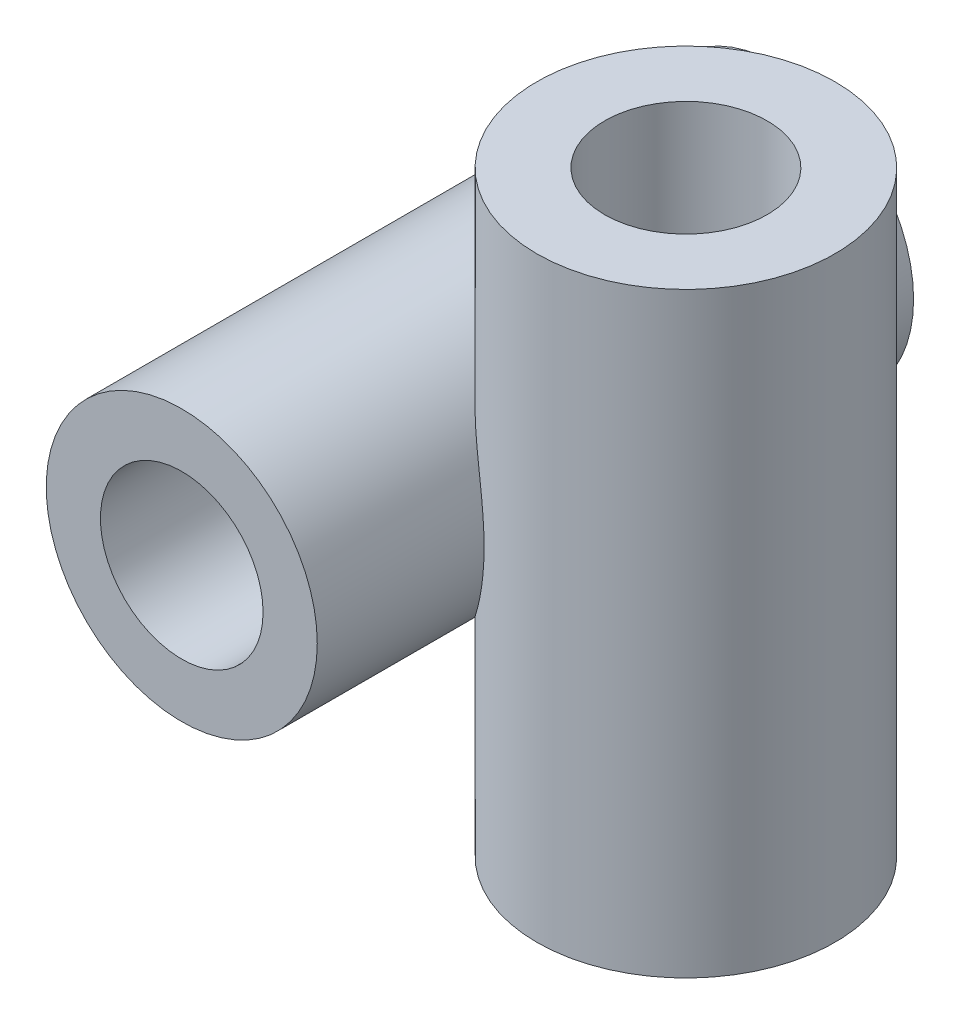
ISO-10303-21;
HEADER;
FILE_DESCRIPTION(('STEP AP214'),'2;1');
FILE_NAME('part.step','',(''),(''),'','','');
FILE_SCHEMA(('AUTOMOTIVE_DESIGN { 1 0 10303 214 1 1 1 1 }'));
ENDSEC;
DATA;
#1=APPLICATION_CONTEXT('core data for automotive mechanical design processes');
#2=APPLICATION_PROTOCOL_DEFINITION('international standard','automotive_design',2000,#1);
#3=PRODUCT_CONTEXT('',#1,'mechanical');
#4=PRODUCT('Part','Part','',(#3));
#5=PRODUCT_RELATED_PRODUCT_CATEGORY('part','',(#4));
#6=PRODUCT_DEFINITION_FORMATION('','',#4);
#7=PRODUCT_DEFINITION_CONTEXT('part definition',#1,'design');
#8=PRODUCT_DEFINITION('design','',#6,#7);
#9=PRODUCT_DEFINITION_SHAPE('','',#8);
#10=(LENGTH_UNIT() NAMED_UNIT(*) SI_UNIT(.MILLI.,.METRE.));
#11=(NAMED_UNIT(*) PLANE_ANGLE_UNIT() SI_UNIT($,.RADIAN.));
#12=(NAMED_UNIT(*) SI_UNIT($,.STERADIAN.) SOLID_ANGLE_UNIT());
#13=UNCERTAINTY_MEASURE_WITH_UNIT(LENGTH_MEASURE(1.E-05),#10,'distance_accuracy_value','');
#14=(GEOMETRIC_REPRESENTATION_CONTEXT(3) GLOBAL_UNCERTAINTY_ASSIGNED_CONTEXT((#13)) GLOBAL_UNIT_ASSIGNED_CONTEXT((#10,
#11,#12)) REPRESENTATION_CONTEXT('',''));
#15=CARTESIAN_POINT('',(0.,0.,0.));
#16=DIRECTION('',(0.,0.,1.));
#17=DIRECTION('',(1.,0.,0.));
#18=AXIS2_PLACEMENT_3D('',#15,#16,#17);
#19=CARTESIAN_POINT('',(0.,0.,110.));
#20=DIRECTION('',(0.,0.,-1.));
#21=DIRECTION('',(-1.,0.,0.));
#22=AXIS2_PLACEMENT_3D('',#19,#20,#21);
#23=CYLINDRICAL_SURFACE('',#22,25.);
#24=CARTESIAN_POINT('',(0.,0.,110.));
#25=DIRECTION('',(0.,0.,1.));
#26=DIRECTION('',(1.,0.,0.));
#27=AXIS2_PLACEMENT_3D('',#24,#25,#26);
#28=CIRCLE('',#27,25.);
#29=CARTESIAN_POINT('',(25.,0.,110.));
#30=VERTEX_POINT('',#29);
#31=EDGE_CURVE('E42',#30,#30,#28,.T.);
#32=ORIENTED_EDGE('',*,*,#31,.F.);
#33=EDGE_LOOP('',(#32));
#34=FACE_BOUND('',#33,.T.);
#35=CARTESIAN_POINT('',(0.,0.,0.));
#36=DIRECTION('',(0.,0.,1.));
#37=DIRECTION('',(1.,0.,0.));
#38=AXIS2_PLACEMENT_3D('',#35,#36,#37);
#39=CIRCLE('',#38,25.);
#40=CARTESIAN_POINT('',(25.,0.,0.));
#41=VERTEX_POINT('',#40);
#42=EDGE_CURVE('E46',#41,#41,#39,.T.);
#43=ORIENTED_EDGE('',*,*,#42,.T.);
#44=EDGE_LOOP('',(#43));
#45=FACE_BOUND('',#44,.T.);
#46=CARTESIAN_POINT('',(25.,0.,79.2332416321053));
#47=CARTESIAN_POINT('',(25.0000007825985,-0.600816842864654,79.2332410858516));
#48=CARTESIAN_POINT('',(24.9783217710084,-1.20162132374293,79.2216494263002));
#49=CARTESIAN_POINT('',(24.8918506726252,-2.39919808909054,79.1749631811382));
#50=CARTESIAN_POINT('',(24.8270596735405,-2.99597047490526,79.1398691884874));
#51=CARTESIAN_POINT('',(24.655121507116,-4.18133721090223,79.0452455780874));
#52=CARTESIAN_POINT('',(24.5479808379827,-4.76993280140982,78.9857197091536));
#53=CARTESIAN_POINT('',(24.2926399312228,-5.93491483313067,78.8407177475658));
#54=CARTESIAN_POINT('',(24.1444395414395,-6.51130122909126,78.7552415587465));
#55=CARTESIAN_POINT('',(23.8085180063826,-7.64899058259393,78.5561039071485));
#56=CARTESIAN_POINT('',(23.6207047510391,-8.21025488587826,78.4423766418513));
#57=CARTESIAN_POINT('',(23.2084644972328,-9.31198548220995,78.1844679143403));
#58=CARTESIAN_POINT('',(22.9840375126994,-9.85245178316974,78.0402864637128));
#59=CARTESIAN_POINT('',(22.5022339022703,-10.9080663425764,77.7190007674117));
#60=CARTESIAN_POINT('',(22.2448713606717,-11.4232252936945,77.5419105800159));
#61=CARTESIAN_POINT('',(21.7016362124861,-12.4243001990804,77.1523130211464));
#62=CARTESIAN_POINT('',(21.4157649861155,-12.9102175672225,76.9398073639395));
#63=CARTESIAN_POINT('',(20.8316029091069,-13.8322635144308,76.4855310011844));
#64=CARTESIAN_POINT('',(20.534117728904,-14.2695493114449,76.2450731185213));
#65=CARTESIAN_POINT('',(19.9234479220036,-15.1104673939661,75.7279582301033));
#66=CARTESIAN_POINT('',(19.6102637492925,-15.5141006517458,75.4513022707589));
#67=CARTESIAN_POINT('',(18.9746159658947,-16.2853813779598,74.8613356253751));
#68=CARTESIAN_POINT('',(18.6521555838678,-16.6530411757564,74.548037579252));
#69=CARTESIAN_POINT('',(18.0044968462312,-17.3512208021058,73.8850341435191));
#70=CARTESIAN_POINT('',(17.6792985669926,-17.6817416629488,73.5353297663573));
#71=CARTESIAN_POINT('',(17.0498353446205,-18.2889103322939,72.8200862352658));
#72=CARTESIAN_POINT('',(16.7453694646409,-18.5674779820506,72.4563491668873));
#73=CARTESIAN_POINT('',(16.1453294165259,-19.0915438736716,71.6990041039122));
#74=CARTESIAN_POINT('',(15.8497549014439,-19.3370434071776,71.3053972769689));
#75=CARTESIAN_POINT('',(15.2723284606574,-19.7962662822146,70.4903980152244));
#76=CARTESIAN_POINT('',(14.9904802784984,-20.009980987435,70.0689980734397));
#77=CARTESIAN_POINT('',(14.4448971265196,-20.4073241806219,69.2010535594379));
#78=CARTESIAN_POINT('',(14.1811630217334,-20.5909512323394,68.7545077882384));
#79=CARTESIAN_POINT('',(13.6634972035866,-20.9382566772376,67.8173544378414));
#80=CARTESIAN_POINT('',(13.4106211621533,-21.1005785575662,67.3256616859445));
#81=CARTESIAN_POINT('',(12.9322018126191,-21.3971352366966,66.3210034042578));
#82=CARTESIAN_POINT('',(12.7066591188469,-21.5313694042643,65.8080373966902));
#83=CARTESIAN_POINT('',(12.2855450455021,-21.7744007774588,64.7639037862788));
#84=CARTESIAN_POINT('',(12.0899840669711,-21.8831891624662,64.2327299447441));
#85=CARTESIAN_POINT('',(11.7310063704868,-22.0777072635418,63.1555120906414));
#86=CARTESIAN_POINT('',(11.5675914440205,-22.1634356945856,62.6094672512481));
#87=CARTESIAN_POINT('',(11.2572811501676,-22.3228047180398,61.4408101254849));
#88=CARTESIAN_POINT('',(11.1145708227286,-22.3938485359219,60.816728560687));
#89=CARTESIAN_POINT('',(10.8727820315224,-22.5122347319977,59.5579496667388));
#90=CARTESIAN_POINT('',(10.7737065258495,-22.5595755033428,58.9232516209021));
#91=CARTESIAN_POINT('',(10.6201389463878,-22.6322752656993,57.6469757557982));
#92=CARTESIAN_POINT('',(10.5656652193296,-22.6576252111434,57.0053952152748));
#93=CARTESIAN_POINT('',(10.501877108889,-22.6872605010107,55.7195073776746));
#94=CARTESIAN_POINT('',(10.4925640351782,-22.691545234537,55.0752000020612));
#95=CARTESIAN_POINT('',(10.5202246376709,-22.6787393960102,53.7377571324116));
#96=CARTESIAN_POINT('',(10.5608434526991,-22.6599655887649,53.0447094477329));
#97=CARTESIAN_POINT('',(10.6942009788091,-22.5973331177627,51.6647480651617));
#98=CARTESIAN_POINT('',(10.7869428438268,-22.5534729360408,50.9778347410113));
#99=CARTESIAN_POINT('',(11.0235422305059,-22.4387790727709,49.6149089037364));
#100=CARTESIAN_POINT('',(11.1674152919376,-22.3679371904867,48.9388997699756));
#101=CARTESIAN_POINT('',(11.5045112775514,-22.1964403506841,47.6031440629806));
#102=CARTESIAN_POINT('',(11.6977329280414,-22.0957861626136,46.9433970705007));
#103=CARTESIAN_POINT('',(12.129984291568,-21.8614645865276,45.6481877789849));
#104=CARTESIAN_POINT('',(12.3688209888673,-21.7279356401813,45.0126362258468));
#105=CARTESIAN_POINT('',(12.8891109356744,-21.4233896570758,43.7684446823527));
#106=CARTESIAN_POINT('',(13.170564816798,-21.2523720646925,43.1598050910231));
#107=CARTESIAN_POINT('',(13.7707277395504,-20.8684868495721,41.9756976388195));
#108=CARTESIAN_POINT('',(14.08939952229,-20.6556609380286,41.4001974495646));
#109=CARTESIAN_POINT('',(14.7575961883041,-20.1836686196567,40.2873638256863));
#110=CARTESIAN_POINT('',(15.1071166606478,-19.924508832506,39.7500249542932));
#111=CARTESIAN_POINT('',(15.7945017798801,-19.383148114334,38.7676069940345));
#112=CARTESIAN_POINT('',(16.1303287842261,-19.105462492978,38.318611021281));
#113=CARTESIAN_POINT('',(16.8132775626075,-18.5072853584889,37.4593644096638));
#114=CARTESIAN_POINT('',(17.1603985776742,-18.1867967172857,37.0491111744506));
#115=CARTESIAN_POINT('',(17.8577591629758,-17.5025382251609,36.2699863693267));
#116=CARTESIAN_POINT('',(18.2079967252408,-17.138794604955,35.9010899808243));
#117=CARTESIAN_POINT('',(18.9034584580386,-16.3685164523194,35.2057090432528));
#118=CARTESIAN_POINT('',(19.2486830070506,-15.9619851696476,34.8792212774161));
#119=CARTESIAN_POINT('',(19.8892054169484,-15.1543954546956,34.3018232318673));
#120=CARTESIAN_POINT('',(20.1858610516938,-14.7575130905319,34.0465572131998));
#121=CARTESIAN_POINT('',(20.7632223300264,-13.9334710370585,33.5690913793213));
#122=CARTESIAN_POINT('',(21.0439292866204,-13.5063138467103,33.346888839648));
#123=CARTESIAN_POINT('',(21.5845842826101,-12.6243162815816,32.934191989825));
#124=CARTESIAN_POINT('',(21.8445277641037,-12.1694698669929,32.7437046317483));
#125=CARTESIAN_POINT('',(22.3393965101202,-11.235248369542,32.3927542079076));
#126=CARTESIAN_POINT('',(22.5743208523798,-10.7558723834266,32.2322922487843));
#127=CARTESIAN_POINT('',(23.0166903519615,-9.77361138835645,31.9387496312583));
#128=CARTESIAN_POINT('',(23.2240012197939,-9.27062650979819,31.805801158817));
#129=CARTESIAN_POINT('',(23.6070048918607,-8.24670395377293,31.5662051512299));
#130=CARTESIAN_POINT('',(23.7826979012818,-7.72576639283752,31.4595574454014));
#131=CARTESIAN_POINT('',(24.1003122820346,-6.66927913686749,31.2706331234371));
#132=CARTESIAN_POINT('',(24.24222696699,-6.13372657215898,31.1883613316948));
#133=CARTESIAN_POINT('',(24.4906221262074,-5.05150562320016,31.0465627087044));
#134=CARTESIAN_POINT('',(24.5971010365473,-4.50483674947228,30.9870368813094));
#135=CARTESIAN_POINT('',(24.779412701567,-3.36671266681171,30.8861511176486));
#136=CARTESIAN_POINT('',(24.8527046672349,-2.77471682077712,30.8462810443092));
#137=CARTESIAN_POINT('',(24.9567836510175,-1.58588789391443,30.7899194993866));
#138=CARTESIAN_POINT('',(24.9875689129989,-0.989054614255886,30.7734289937123));
#139=CARTESIAN_POINT('',(25.0062936911526,0.205663305145473,30.7633806679282));
#140=CARTESIAN_POINT('',(24.9942200151511,0.803548211973766,30.7698299087769));
#141=CARTESIAN_POINT('',(24.927330991816,1.99622768247204,30.8058528723143));
#142=CARTESIAN_POINT('',(24.8725151410998,2.59102220966299,30.8354268673476));
#143=CARTESIAN_POINT('',(24.7181344096628,3.79395206336295,30.9199234832875));
#144=CARTESIAN_POINT('',(24.6170910435352,4.40183976869141,30.9756853678659));
#145=CARTESIAN_POINT('',(24.3711898757551,5.60557411165142,31.1143257748296));
#146=CARTESIAN_POINT('',(24.2263307322023,6.20142037990609,31.1972051277197));
#147=CARTESIAN_POINT('',(23.894796054939,7.37639817667953,31.3921586353657));
#148=CARTESIAN_POINT('',(23.7081268170234,7.95553220693361,31.5042283950222));
#149=CARTESIAN_POINT('',(23.2957465968666,9.09251413558756,31.7600824260663));
#150=CARTESIAN_POINT('',(23.0700372367068,9.65036291719511,31.903865379868));
#151=CARTESIAN_POINT('',(22.5895110020288,10.7262385165462,32.2217730880238));
#152=CARTESIAN_POINT('',(22.3355827884744,11.24491795568,32.3950309545323));
#153=CARTESIAN_POINT('',(21.7985942143192,12.2534739103187,32.7767488627537));
#154=CARTESIAN_POINT('',(21.5155343986323,12.7433509643103,32.9852082460602));
#155=CARTESIAN_POINT('',(20.9258731721937,13.690092314002,33.4393299163769));
#156=CARTESIAN_POINT('',(20.6192883231338,14.1469794027957,33.6849661471198));
#157=CARTESIAN_POINT('',(19.9887026209474,15.0247718560083,34.2150849799302));
#158=CARTESIAN_POINT('',(19.6647029336007,15.4456796240719,34.4995649836866));
#159=CARTESIAN_POINT('',(19.0285618688237,16.2218506260967,35.0874614718129));
#160=CARTESIAN_POINT('',(18.7170989093392,16.5796278294508,35.388298852999));
#161=CARTESIAN_POINT('',(18.0911284829496,17.2605021386174,36.0240741158544));
#162=CARTESIAN_POINT('',(17.7766211695509,17.5836009831973,36.3590102861734));
#163=CARTESIAN_POINT('',(17.1505656522716,18.1947670723813,37.0619790980615));
#164=CARTESIAN_POINT('',(16.839017578199,18.4828327867281,37.4300131841365));
#165=CARTESIAN_POINT('',(16.2246583017486,19.0244110116165,38.1974385968582));
#166=CARTESIAN_POINT('',(15.9218472610151,19.2779228831982,38.5968305031497));
#167=CARTESIAN_POINT('',(15.3339601740984,19.7486644963908,39.4194662740109));
#168=CARTESIAN_POINT('',(15.0487094929935,19.966308924808,39.842348711975));
#169=CARTESIAN_POINT('',(14.4963558120442,20.3708837903776,40.7138226903922));
#170=CARTESIAN_POINT('',(14.2292525475791,20.5578146754427,41.1624138557918));
#171=CARTESIAN_POINT('',(13.7168948113907,20.9031651468815,42.0826380711199));
#172=CARTESIAN_POINT('',(13.4716473801915,21.0615755624659,42.5542784707939));
#173=CARTESIAN_POINT('',(13.006199751705,21.3521440488596,43.5175712597812));
#174=CARTESIAN_POINT('',(12.786001006194,21.4843005983735,44.0092248067801));
#175=CARTESIAN_POINT('',(12.353680399971,21.7360295551102,45.0568174936471));
#176=CARTESIAN_POINT('',(12.1442773810257,21.8532407753032,45.6144472700704));
#177=CARTESIAN_POINT('',(11.7609765555144,22.0618914030469,46.7464645280521));
#178=CARTESIAN_POINT('',(11.5870805561972,22.1533294988781,47.3208528608938));
#179=CARTESIAN_POINT('',(11.2765888262965,22.3129793471007,48.4830079259348));
#180=CARTESIAN_POINT('',(11.1400071507714,22.3811823499917,49.0707796091348));
#181=CARTESIAN_POINT('',(10.9055382650663,22.4963613363144,50.2560376166145));
#182=CARTESIAN_POINT('',(10.8076528341253,22.543336343705,50.8535243862755));
#183=CARTESIAN_POINT('',(10.6429283450613,22.6216133272276,52.1204343032458));
#184=CARTESIAN_POINT('',(10.5806412604853,22.6506463881822,52.7905942694813));
#185=CARTESIAN_POINT('',(10.5053921700264,22.6856436471179,54.1342999410958));
#186=CARTESIAN_POINT('',(10.492433605034,22.6916062358282,54.8078458793806));
#187=CARTESIAN_POINT('',(10.5159808624031,22.6807038395337,56.1541939723668));
#188=CARTESIAN_POINT('',(10.5525085400216,22.6638287684377,56.8269956670143));
#189=CARTESIAN_POINT('',(10.6746988501272,22.6065331300018,58.1671198421164));
#190=CARTESIAN_POINT('',(10.7603618749436,22.5661123746575,58.8344422787776));
#191=CARTESIAN_POINT('',(10.9842817527632,22.4579978394343,60.1853695796687));
#192=CARTESIAN_POINT('',(11.1244881661839,22.3892868149027,60.8685718186756));
#193=CARTESIAN_POINT('',(11.4553242035815,22.2218336972056,62.2189624620404));
#194=CARTESIAN_POINT('',(11.6459560797036,22.1230902626773,62.8861501496905));
#195=CARTESIAN_POINT('',(12.0749653120591,21.8918831934127,64.1988707729586));
#196=CARTESIAN_POINT('',(12.3133321151002,21.7594270101082,64.8444084581762));
#197=CARTESIAN_POINT('',(12.8340721507263,21.4564041024355,66.1082407089778));
#198=CARTESIAN_POINT('',(13.1164419501342,21.2858403508249,66.7265373951202));
#199=CARTESIAN_POINT('',(13.7055977167641,20.9110610931717,67.901277142235));
#200=CARTESIAN_POINT('',(14.0105724569732,20.7088428454806,68.4592640419484));
#201=CARTESIAN_POINT('',(14.6499176767715,20.2615892410081,69.5402146251458));
#202=CARTESIAN_POINT('',(14.9842873298948,20.0165550878452,70.0631792925852));
#203=CARTESIAN_POINT('',(15.6747535250371,19.4805741039039,71.0687564691591));
#204=CARTESIAN_POINT('',(16.0308240797699,19.1896815517031,71.5514156640705));
#205=CARTESIAN_POINT('',(16.7564354031537,18.559432552769,72.4729734858819));
#206=CARTESIAN_POINT('',(17.1259742012438,18.220083174802,72.9118784797099));
#207=CARTESIAN_POINT('',(17.824139716517,17.5359435971529,73.6929201702806));
#208=CARTESIAN_POINT('',(18.1523336673437,17.1967307940524,74.0403450194287));
#209=CARTESIAN_POINT('',(18.8048571640106,16.4806510206028,74.6979958362192));
#210=CARTESIAN_POINT('',(19.1291870390442,16.1037872839094,75.0082249933926));
#211=CARTESIAN_POINT('',(19.7671872869556,15.3139157558371,75.5912942381544));
#212=CARTESIAN_POINT('',(20.0808581927236,14.9009097750752,75.8641361969731));
#213=CARTESIAN_POINT('',(20.6911734461569,14.0411260215069,76.3731724913068));
#214=CARTESIAN_POINT('',(20.9878178638289,13.5943483875752,76.60936697751));
#215=CARTESIAN_POINT('',(21.5409594796526,12.6983156184224,77.0332466464884));
#216=CARTESIAN_POINT('',(21.7988014976709,12.2508691135941,77.2230103010925));
#217=CARTESIAN_POINT('',(22.2903349318559,11.3319222585164,77.5731590239365));
#218=CARTESIAN_POINT('',(22.524027886978,10.8604234439206,77.7335459647799));
#219=CARTESIAN_POINT('',(22.9639671780156,9.89631775088928,78.0268906032419));
#220=CARTESIAN_POINT('',(23.1702020667976,9.40370218141559,78.15983687361));
#221=CARTESIAN_POINT('',(23.5523863747141,8.40078403250383,78.4001585349046));
#222=CARTESIAN_POINT('',(23.7283328496879,7.89047973943313,78.5075314403815));
#223=CARTESIAN_POINT('',(24.0700261718713,6.78339259924081,78.7118305806663));
#224=CARTESIAN_POINT('',(24.230944216107,6.18445969763318,78.8052222741279));
#225=CARTESIAN_POINT('',(24.5083456977109,4.97267338956691,78.9635299139977));
#226=CARTESIAN_POINT('',(24.6248240157393,4.3598183879298,79.0284425798259));
#227=CARTESIAN_POINT('',(24.8118162492743,3.12473900353335,79.1315815023734));
#228=CARTESIAN_POINT('',(24.8823163126842,2.50251185489195,79.1697997169691));
#229=CARTESIAN_POINT('',(24.9764064559061,1.25351848125742,79.2206293440454));
#230=CARTESIAN_POINT('',(24.9999991836188,0.626752514483525,79.2332422019393));
#231=CARTESIAN_POINT('',(25.,0.,79.2332416321053));
#232=B_SPLINE_CURVE_WITH_KNOTS('',3,(#46,#47,#48,#49,#50,#51,#52,#53,#54,#55,#56,#57,#58,#59,
#60,#61,#62,#63,#64,#65,#66,#67,#68,#69,#70,#71,#72,#73,#74,#75,#76,#77,#78,#79,#80,#81,#82,#83,
#84,#85,#86,#87,#88,#89,#90,#91,#92,#93,#94,#95,#96,#97,#98,#99,#100,#101,#102,#103,#104,#105,
#106,#107,#108,#109,#110,#111,#112,#113,#114,#115,#116,#117,#118,#119,#120,#121,#122,#123,#124,
#125,#126,#127,#128,#129,#130,#131,#132,#133,#134,#135,#136,#137,#138,#139,#140,#141,#142,#143,
#144,#145,#146,#147,#148,#149,#150,#151,#152,#153,#154,#155,#156,#157,#158,#159,#160,#161,#162,
#163,#164,#165,#166,#167,#168,#169,#170,#171,#172,#173,#174,#175,#176,#177,#178,#179,#180,#181,
#182,#183,#184,#185,#186,#187,#188,#189,#190,#191,#192,#193,#194,#195,#196,#197,#198,#199,#200,
#201,#202,#203,#204,#205,#206,#207,#208,#209,#210,#211,#212,#213,#214,#215,#216,#217,#218,#219,
#220,#221,#222,#223,#224,#225,#226,#227,#228,#229,#230,#231),.UNSPECIFIED.,.T.,.F.,(4,2,2,2,2,2,
2,2,2,2,2,2,2,2,2,2,2,2,2,2,2,2,2,2,2,2,2,2,2,2,2,2,2,2,2,2,2,2,2,2,2,2,2,2,2,2,2,2,2,2,2,2,2,2,
2,2,2,2,2,2,2,2,2,2,2,2,2,2,2,2,2,2,2,2,2,2,2,2,2,2,2,2,2,2,2,2,2,2,2,2,2,2,4),(0.,
1.80192582446292,3.60380618835748,5.40541017588423,7.20702083978275,9.01286782851568,
10.8187141302234,12.6237907587882,14.4287800389481,16.169443978432,17.9100576100759,
19.6500725673829,21.390039148368,23.038429662563,24.6867557718875,26.335528935724,
27.9843807816586,29.7113167089126,31.4382914425928,33.1658639368576,34.8935326808026,
36.8238198754273,38.754237908055,40.6854496106382,42.6167173185665,44.6977383500462,
46.778885316478,48.8606653258225,50.9423916096445,53.0154969727568,55.0886330637129,
57.1597112439346,59.2304937672483,61.1049107451811,62.979202019546,64.8523624261062,
66.7253806671223,68.3955370364489,70.065555706988,71.7359399705664,73.4063857870775,
75.0846797640616,76.7629628492239,78.4415778726107,80.120266970156,81.9117836014776,
83.7033742457831,85.4955163975557,87.2876796560386,89.1416676664756,90.9957124628243,
92.8494782632124,94.7031670598192,96.5096026817866,98.3160045200667,100.121146112416,
101.92616701556,103.609200215129,105.292148988218,106.975171246612,108.658224622759,
110.320196464223,111.982144066069,113.644625118315,115.307202475912,117.126529920531,
118.945949942851,120.766054337967,122.58624241108,124.605002672754,126.623903749636,
128.643696750953,130.663505879866,132.763351399395,134.863290719866,136.962766299256,
139.062078156474,141.061085200279,143.060036058069,145.056638454703,147.052949888723,
148.808835374583,150.564570185399,152.32021708952,154.075856774523,155.72455525661,
157.373148606651,159.022427109361,160.671865838442,162.550899841244,164.430150238521,
166.309966545655,168.189676734887),.UNSPECIFIED.);
#233=CARTESIAN_POINT('',(25.,0.,79.2332416321053));
#234=VERTEX_POINT('',#233);
#235=EDGE_CURVE('E10',#234,#234,#232,.T.);
#236=ORIENTED_EDGE('',*,*,#235,.F.);
#237=EDGE_LOOP('',(#236));
#238=FACE_BOUND('',#237,.T.);
#239=ADVANCED_FACE('F31',(#34,#45,#238),#23,.T.);
#240=CARTESIAN_POINT('',(0.,0.,110.));
#241=DIRECTION('',(0.,0.,1.));
#242=DIRECTION('',(1.,0.,0.));
#243=AXIS2_PLACEMENT_3D('',#240,#241,#242);
#244=PLANE('',#243);
#245=CARTESIAN_POINT('',(0.,0.,110.));
#246=DIRECTION('',(0.,0.,1.));
#247=DIRECTION('',(1.,0.,0.));
#248=AXIS2_PLACEMENT_3D('',#245,#246,#247);
#249=CIRCLE('',#248,15.);
#250=CARTESIAN_POINT('',(15.,0.,110.));
#251=VERTEX_POINT('',#250);
#252=EDGE_CURVE('E61',#251,#251,#249,.T.);
#253=ORIENTED_EDGE('',*,*,#252,.F.);
#254=EDGE_LOOP('',(#253));
#255=FACE_BOUND('',#254,.T.);
#256=ORIENTED_EDGE('',*,*,#31,.T.);
#257=EDGE_LOOP('',(#256));
#258=FACE_BOUND('',#257,.T.);
#259=ADVANCED_FACE('F87',(#255,#258),#244,.T.);
#260=CARTESIAN_POINT('',(0.,0.,0.));
#261=DIRECTION('',(0.,0.,1.));
#262=DIRECTION('',(1.,0.,0.));
#263=AXIS2_PLACEMENT_3D('',#260,#261,#262);
#264=PLANE('',#263);
#265=CARTESIAN_POINT('',(0.,0.,0.));
#266=DIRECTION('',(0.,0.,1.));
#267=DIRECTION('',(1.,0.,0.));
#268=AXIS2_PLACEMENT_3D('',#265,#266,#267);
#269=CIRCLE('',#268,15.);
#270=CARTESIAN_POINT('',(15.,0.,0.));
#271=VERTEX_POINT('',#270);
#272=EDGE_CURVE('E56',#271,#271,#269,.F.);
#273=ORIENTED_EDGE('',*,*,#272,.F.);
#274=EDGE_LOOP('',(#273));
#275=FACE_BOUND('',#274,.T.);
#276=ORIENTED_EDGE('',*,*,#42,.F.);
#277=EDGE_LOOP('',(#276));
#278=FACE_BOUND('',#277,.T.);
#279=ADVANCED_FACE('F82',(#275,#278),#264,.F.);
#280=CARTESIAN_POINT('',(38.,55.,55.));
#281=DIRECTION('',(0.,-1.,0.));
#282=DIRECTION('',(0.,0.,-1.));
#283=AXIS2_PLACEMENT_3D('',#280,#281,#282);
#284=CYLINDRICAL_SURFACE('',#283,27.5);
#285=CARTESIAN_POINT('',(38.,-55.,55.));
#286=DIRECTION('',(0.,1.,0.));
#287=DIRECTION('',(0.,0.,1.));
#288=AXIS2_PLACEMENT_3D('',#285,#286,#287);
#289=CIRCLE('',#288,27.5);
#290=CARTESIAN_POINT('',(38.,-55.,82.5));
#291=VERTEX_POINT('',#290);
#292=EDGE_CURVE('E53',#291,#291,#289,.T.);
#293=ORIENTED_EDGE('',*,*,#292,.T.);
#294=EDGE_LOOP('',(#293));
#295=FACE_BOUND('',#294,.T.);
#296=CARTESIAN_POINT('',(38.,55.,55.));
#297=DIRECTION('',(0.,1.,0.));
#298=DIRECTION('',(0.,0.,1.));
#299=AXIS2_PLACEMENT_3D('',#296,#297,#298);
#300=CIRCLE('',#299,27.5);
#301=CARTESIAN_POINT('',(38.,55.,82.5));
#302=VERTEX_POINT('',#301);
#303=EDGE_CURVE('E51',#302,#302,#300,.T.);
#304=ORIENTED_EDGE('',*,*,#303,.F.);
#305=EDGE_LOOP('',(#304));
#306=FACE_BOUND('',#305,.T.);
#307=ORIENTED_EDGE('',*,*,#235,.T.);
#308=EDGE_LOOP('',(#307));
#309=FACE_BOUND('',#308,.T.);
#310=ADVANCED_FACE('F77',(#295,#306,#309),#284,.T.);
#311=CARTESIAN_POINT('',(38.,55.,55.));
#312=DIRECTION('',(0.,1.,0.));
#313=DIRECTION('',(0.,0.,1.));
#314=AXIS2_PLACEMENT_3D('',#311,#312,#313);
#315=PLANE('',#314);
#316=CARTESIAN_POINT('',(38.,55.,55.));
#317=DIRECTION('',(0.,1.,0.));
#318=DIRECTION('',(0.,0.,1.));
#319=AXIS2_PLACEMENT_3D('',#316,#317,#318);
#320=CIRCLE('',#319,15.);
#321=CARTESIAN_POINT('',(38.,55.,70.));
#322=VERTEX_POINT('',#321);
#323=EDGE_CURVE('E67',#322,#322,#320,.T.);
#324=ORIENTED_EDGE('',*,*,#323,.F.);
#325=EDGE_LOOP('',(#324));
#326=FACE_BOUND('',#325,.T.);
#327=ORIENTED_EDGE('',*,*,#303,.T.);
#328=EDGE_LOOP('',(#327));
#329=FACE_BOUND('',#328,.T.);
#330=ADVANCED_FACE('F73',(#326,#329),#315,.T.);
#331=CARTESIAN_POINT('',(38.,-55.,55.));
#332=DIRECTION('',(0.,1.,0.));
#333=DIRECTION('',(0.,0.,1.));
#334=AXIS2_PLACEMENT_3D('',#331,#332,#333);
#335=PLANE('',#334);
#336=CARTESIAN_POINT('',(38.,-55.,55.));
#337=DIRECTION('',(0.,1.,0.));
#338=DIRECTION('',(0.,0.,1.));
#339=AXIS2_PLACEMENT_3D('',#336,#337,#338);
#340=CIRCLE('',#339,15.);
#341=CARTESIAN_POINT('',(38.,-55.,70.));
#342=VERTEX_POINT('',#341);
#343=EDGE_CURVE('E64',#342,#342,#340,.F.);
#344=ORIENTED_EDGE('',*,*,#343,.F.);
#345=EDGE_LOOP('',(#344));
#346=FACE_BOUND('',#345,.T.);
#347=ORIENTED_EDGE('',*,*,#292,.F.);
#348=EDGE_LOOP('',(#347));
#349=FACE_BOUND('',#348,.T.);
#350=ADVANCED_FACE('F76',(#346,#349),#335,.F.);
#351=CARTESIAN_POINT('',(0.,0.,-42.4264068711929));
#352=DIRECTION('',(0.,0.,1.));
#353=DIRECTION('',(1.,0.,0.));
#354=AXIS2_PLACEMENT_3D('',#351,#352,#353);
#355=CYLINDRICAL_SURFACE('',#354,15.);
#356=ORIENTED_EDGE('',*,*,#272,.T.);
#357=EDGE_LOOP('',(#356));
#358=FACE_BOUND('',#357,.T.);
#359=ORIENTED_EDGE('',*,*,#252,.T.);
#360=EDGE_LOOP('',(#359));
#361=FACE_BOUND('',#360,.T.);
#362=ADVANCED_FACE('F106',(#358,#361),#355,.F.);
#363=CARTESIAN_POINT('',(38.,-97.4264068711929,55.));
#364=DIRECTION('',(0.,1.,0.));
#365=DIRECTION('',(0.,0.,1.));
#366=AXIS2_PLACEMENT_3D('',#363,#364,#365);
#367=CYLINDRICAL_SURFACE('',#366,15.);
#368=ORIENTED_EDGE('',*,*,#343,.T.);
#369=EDGE_LOOP('',(#368));
#370=FACE_BOUND('',#369,.T.);
#371=ORIENTED_EDGE('',*,*,#323,.T.);
#372=EDGE_LOOP('',(#371));
#373=FACE_BOUND('',#372,.T.);
#374=ADVANCED_FACE('F71',(#370,#373),#367,.F.);
#375=CLOSED_SHELL('',(#239,#259,#279,#310,#330,#350,#362,#374));
#376=MANIFOLD_SOLID_BREP('B2',#375);
#377=ADVANCED_BREP_SHAPE_REPRESENTATION('',(#18,#376),#14);
#378=SHAPE_DEFINITION_REPRESENTATION(#9,#377);
ENDSEC;
END-ISO-10303-21;
